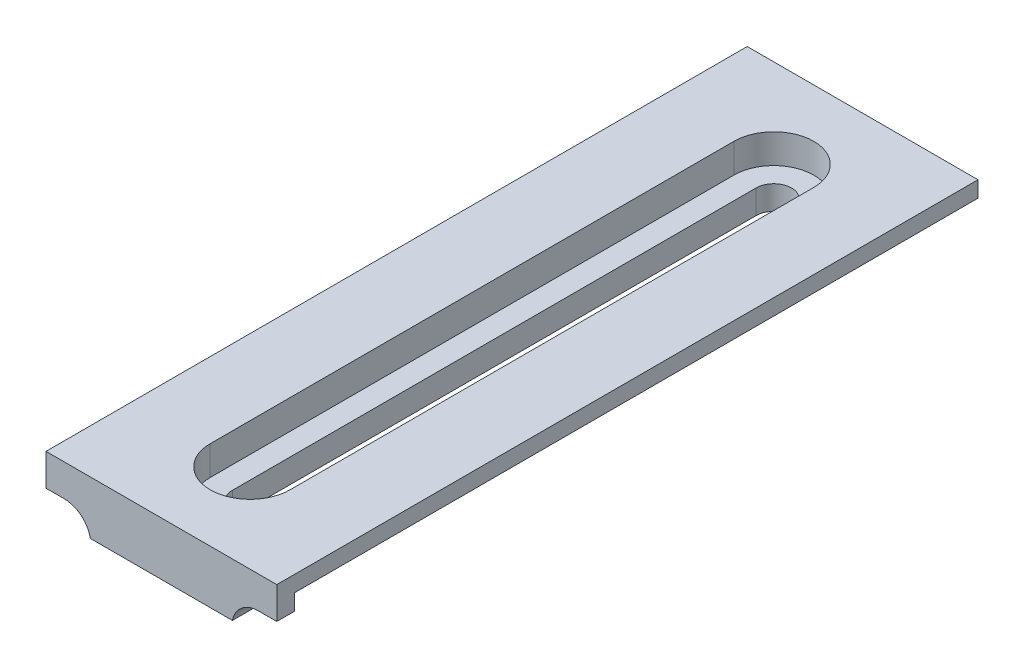
ISO-10303-21;
HEADER;
FILE_DESCRIPTION(('STEP AP214'),'2;1');
FILE_NAME('part.step','',(''),(''),'','','');
FILE_SCHEMA(('AUTOMOTIVE_DESIGN { 1 0 10303 214 1 1 1 1 }'));
ENDSEC;
DATA;
#1=APPLICATION_CONTEXT('core data for automotive mechanical design processes');
#2=APPLICATION_PROTOCOL_DEFINITION('international standard','automotive_design',2000,#1);
#3=PRODUCT_CONTEXT('',#1,'mechanical');
#4=PRODUCT('Part','Part','',(#3));
#5=PRODUCT_RELATED_PRODUCT_CATEGORY('part','',(#4));
#6=PRODUCT_DEFINITION_FORMATION('','',#4);
#7=PRODUCT_DEFINITION_CONTEXT('part definition',#1,'design');
#8=PRODUCT_DEFINITION('design','',#6,#7);
#9=PRODUCT_DEFINITION_SHAPE('','',#8);
#10=(LENGTH_UNIT() NAMED_UNIT(*) SI_UNIT(.MILLI.,.METRE.));
#11=(NAMED_UNIT(*) PLANE_ANGLE_UNIT() SI_UNIT($,.RADIAN.));
#12=(NAMED_UNIT(*) SI_UNIT($,.STERADIAN.) SOLID_ANGLE_UNIT());
#13=UNCERTAINTY_MEASURE_WITH_UNIT(LENGTH_MEASURE(1.E-05),#10,'distance_accuracy_value','');
#14=(GEOMETRIC_REPRESENTATION_CONTEXT(3) GLOBAL_UNCERTAINTY_ASSIGNED_CONTEXT((#13)) GLOBAL_UNIT_ASSIGNED_CONTEXT((#10,
#11,#12)) REPRESENTATION_CONTEXT('',''));
#15=CARTESIAN_POINT('',(0.,0.,0.));
#16=DIRECTION('',(0.,0.,1.));
#17=DIRECTION('',(1.,0.,0.));
#18=AXIS2_PLACEMENT_3D('',#15,#16,#17);
#19=CARTESIAN_POINT('',(-8.,0.,79.));
#20=DIRECTION('',(0.,1.,0.));
#21=DIRECTION('',(-1.,0.,0.));
#22=AXIS2_PLACEMENT_3D('',#19,#20,#21);
#23=PLANE('',#22);
#24=DIRECTION('',(1.,0.,0.));
#25=VECTOR('',#24,1.);
#26=CARTESIAN_POINT('',(-8.,0.,77.));
#27=LINE('',#26,#25);
#28=CARTESIAN_POINT('',(-13.,0.,77.));
#29=VERTEX_POINT('',#28);
#30=CARTESIAN_POINT('',(-8.,0.,77.));
#31=VERTEX_POINT('',#30);
#32=EDGE_CURVE('E208',#29,#31,#27,.T.);
#33=ORIENTED_EDGE('',*,*,#32,.F.);
#34=DIRECTION('',(0.,0.,-1.));
#35=VECTOR('',#34,1.);
#36=CARTESIAN_POINT('',(-13.,0.,79.));
#37=LINE('',#36,#35);
#38=CARTESIAN_POINT('',(-13.,0.,0.));
#39=VERTEX_POINT('',#38);
#40=EDGE_CURVE('E183',#29,#39,#37,.T.);
#41=ORIENTED_EDGE('',*,*,#40,.T.);
#42=DIRECTION('',(1.,0.,0.));
#43=VECTOR('',#42,1.);
#44=CARTESIAN_POINT('',(-8.,0.,0.));
#45=LINE('',#44,#43);
#46=CARTESIAN_POINT('',(-8.,0.,0.));
#47=VERTEX_POINT('',#46);
#48=EDGE_CURVE('E263',#39,#47,#45,.T.);
#49=ORIENTED_EDGE('',*,*,#48,.T.);
#50=DIRECTION('',(0.,0.,-1.));
#51=VECTOR('',#50,1.);
#52=CARTESIAN_POINT('',(-8.,0.,79.));
#53=LINE('',#52,#51);
#54=EDGE_CURVE('E317',#31,#47,#53,.T.);
#55=ORIENTED_EDGE('',*,*,#54,.F.);
#56=EDGE_LOOP('',(#33,#41,#49,#55));
#57=FACE_BOUND('',#56,.T.);
#58=ADVANCED_FACE('F34',(#57),#23,.F.);
#59=CARTESIAN_POINT('',(13.,0.,79.));
#60=DIRECTION('',(0.,1.,0.));
#61=DIRECTION('',(-1.,0.,0.));
#62=AXIS2_PLACEMENT_3D('',#59,#60,#61);
#63=PLANE('',#62);
#64=DIRECTION('',(1.,0.,0.));
#65=VECTOR('',#64,1.);
#66=CARTESIAN_POINT('',(13.,0.,77.));
#67=LINE('',#66,#65);
#68=CARTESIAN_POINT('',(8.,0.,77.));
#69=VERTEX_POINT('',#68);
#70=CARTESIAN_POINT('',(13.,0.,77.));
#71=VERTEX_POINT('',#70);
#72=EDGE_CURVE('E201',#69,#71,#67,.T.);
#73=ORIENTED_EDGE('',*,*,#72,.F.);
#74=DIRECTION('',(0.,0.,-1.));
#75=VECTOR('',#74,1.);
#76=CARTESIAN_POINT('',(8.,0.,79.));
#77=LINE('',#76,#75);
#78=CARTESIAN_POINT('',(8.,0.,0.));
#79=VERTEX_POINT('',#78);
#80=EDGE_CURVE('E307',#69,#79,#77,.T.);
#81=ORIENTED_EDGE('',*,*,#80,.T.);
#82=DIRECTION('',(1.,0.,0.));
#83=VECTOR('',#82,1.);
#84=CARTESIAN_POINT('',(13.,0.,0.));
#85=LINE('',#84,#83);
#86=CARTESIAN_POINT('',(13.,0.,0.));
#87=VERTEX_POINT('',#86);
#88=EDGE_CURVE('E290',#79,#87,#85,.T.);
#89=ORIENTED_EDGE('',*,*,#88,.T.);
#90=DIRECTION('',(0.,0.,-1.));
#91=VECTOR('',#90,1.);
#92=CARTESIAN_POINT('',(13.,0.,79.));
#93=LINE('',#92,#91);
#94=EDGE_CURVE('E305',#71,#87,#93,.T.);
#95=ORIENTED_EDGE('',*,*,#94,.F.);
#96=EDGE_LOOP('',(#73,#81,#89,#95));
#97=FACE_BOUND('',#96,.T.);
#98=ADVANCED_FACE('F365',(#97),#63,.F.);
#99=CARTESIAN_POINT('',(0.,1.8,69.));
#100=DIRECTION('',(0.,-1.,0.));
#101=DIRECTION('',(0.,0.,-1.));
#102=AXIS2_PLACEMENT_3D('',#99,#100,#101);
#103=CYLINDRICAL_SURFACE('',#102,2.);
#104=CARTESIAN_POINT('',(0.,-1.5,69.));
#105=DIRECTION('',(0.,1.,0.));
#106=DIRECTION('',(0.,0.,1.));
#107=AXIS2_PLACEMENT_3D('',#104,#105,#106);
#108=CIRCLE('',#107,2.);
#109=CARTESIAN_POINT('',(2.,-1.5,69.));
#110=VERTEX_POINT('',#109);
#111=CARTESIAN_POINT('',(-2.,-1.5,69.));
#112=VERTEX_POINT('',#111);
#113=EDGE_CURVE('E246',#110,#112,#108,.F.);
#114=ORIENTED_EDGE('',*,*,#113,.F.);
#115=DIRECTION('',(0.,-1.,0.));
#116=VECTOR('',#115,1.);
#117=CARTESIAN_POINT('',(2.,1.8,69.));
#118=LINE('',#117,#116);
#119=CARTESIAN_POINT('',(2.,-4.2,69.));
#120=VERTEX_POINT('',#119);
#121=EDGE_CURVE('E261',#110,#120,#118,.T.);
#122=ORIENTED_EDGE('',*,*,#121,.T.);
#123=CARTESIAN_POINT('',(0.,-4.2,69.));
#124=DIRECTION('',(0.,-1.,0.));
#125=DIRECTION('',(0.,0.,-1.));
#126=AXIS2_PLACEMENT_3D('',#123,#124,#125);
#127=CIRCLE('',#126,2.);
#128=CARTESIAN_POINT('',(-2.,-4.2,69.));
#129=VERTEX_POINT('',#128);
#130=EDGE_CURVE('E248',#120,#129,#127,.T.);
#131=ORIENTED_EDGE('',*,*,#130,.T.);
#132=DIRECTION('',(0.,-1.,0.));
#133=VECTOR('',#132,1.);
#134=CARTESIAN_POINT('',(-2.,1.8,69.));
#135=LINE('',#134,#133);
#136=EDGE_CURVE('E260',#112,#129,#135,.T.);
#137=ORIENTED_EDGE('',*,*,#136,.F.);
#138=EDGE_LOOP('',(#114,#122,#131,#137));
#139=FACE_BOUND('',#138,.T.);
#140=ADVANCED_FACE('F387',(#139),#103,.F.);
#141=CARTESIAN_POINT('',(2.,1.8,69.));
#142=DIRECTION('',(1.,0.,0.));
#143=DIRECTION('',(0.,0.,-1.));
#144=AXIS2_PLACEMENT_3D('',#141,#142,#143);
#145=PLANE('',#144);
#146=DIRECTION('',(0.,0.,1.));
#147=VECTOR('',#146,1.);
#148=CARTESIAN_POINT('',(2.,-1.5,69.));
#149=LINE('',#148,#147);
#150=CARTESIAN_POINT('',(2.00000000000001,-1.5,10.));
#151=VERTEX_POINT('',#150);
#152=EDGE_CURVE('E244',#151,#110,#149,.T.);
#153=ORIENTED_EDGE('',*,*,#152,.F.);
#154=DIRECTION('',(0.,-1.,0.));
#155=VECTOR('',#154,1.);
#156=CARTESIAN_POINT('',(2.00000000000001,1.8,10.));
#157=LINE('',#156,#155);
#158=CARTESIAN_POINT('',(2.00000000000001,-4.2,10.));
#159=VERTEX_POINT('',#158);
#160=EDGE_CURVE('E264',#151,#159,#157,.T.);
#161=ORIENTED_EDGE('',*,*,#160,.T.);
#162=DIRECTION('',(0.,0.,1.));
#163=VECTOR('',#162,1.);
#164=CARTESIAN_POINT('',(2.,-4.2,69.));
#165=LINE('',#164,#163);
#166=EDGE_CURVE('E257',#159,#120,#165,.T.);
#167=ORIENTED_EDGE('',*,*,#166,.T.);
#168=ORIENTED_EDGE('',*,*,#121,.F.);
#169=EDGE_LOOP('',(#153,#161,#167,#168));
#170=FACE_BOUND('',#169,.T.);
#171=ADVANCED_FACE('F426',(#170),#145,.F.);
#172=CARTESIAN_POINT('',(0.,1.8,10.));
#173=DIRECTION('',(0.,-1.,0.));
#174=DIRECTION('',(0.,0.,-1.));
#175=AXIS2_PLACEMENT_3D('',#172,#173,#174);
#176=CYLINDRICAL_SURFACE('',#175,2.);
#177=CARTESIAN_POINT('',(0.,-1.5,10.));
#178=DIRECTION('',(0.,1.,0.));
#179=DIRECTION('',(0.,0.,1.));
#180=AXIS2_PLACEMENT_3D('',#177,#178,#179);
#181=CIRCLE('',#180,2.);
#182=CARTESIAN_POINT('',(-2.,-1.5,10.));
#183=VERTEX_POINT('',#182);
#184=EDGE_CURVE('E236',#183,#151,#181,.F.);
#185=ORIENTED_EDGE('',*,*,#184,.F.);
#186=DIRECTION('',(0.,-1.,0.));
#187=VECTOR('',#186,1.);
#188=CARTESIAN_POINT('',(-1.99999999999999,1.8,10.));
#189=LINE('',#188,#187);
#190=CARTESIAN_POINT('',(-1.99999999999999,-4.2,10.));
#191=VERTEX_POINT('',#190);
#192=EDGE_CURVE('E266',#183,#191,#189,.T.);
#193=ORIENTED_EDGE('',*,*,#192,.T.);
#194=CARTESIAN_POINT('',(0.,-4.2,10.));
#195=DIRECTION('',(0.,-1.,0.));
#196=DIRECTION('',(0.,0.,-1.));
#197=AXIS2_PLACEMENT_3D('',#194,#195,#196);
#198=CIRCLE('',#197,2.);
#199=EDGE_CURVE('E254',#191,#159,#198,.T.);
#200=ORIENTED_EDGE('',*,*,#199,.T.);
#201=ORIENTED_EDGE('',*,*,#160,.F.);
#202=EDGE_LOOP('',(#185,#193,#200,#201));
#203=FACE_BOUND('',#202,.T.);
#204=ADVANCED_FACE('F429',(#203),#176,.F.);
#205=CARTESIAN_POINT('',(-2.,1.8,69.));
#206=DIRECTION('',(-1.,0.,0.));
#207=DIRECTION('',(0.,0.,1.));
#208=AXIS2_PLACEMENT_3D('',#205,#206,#207);
#209=PLANE('',#208);
#210=DIRECTION('',(0.,0.,-1.));
#211=VECTOR('',#210,1.);
#212=CARTESIAN_POINT('',(-2.,-1.5,69.));
#213=LINE('',#212,#211);
#214=EDGE_CURVE('E319',#112,#183,#213,.T.);
#215=ORIENTED_EDGE('',*,*,#214,.F.);
#216=ORIENTED_EDGE('',*,*,#136,.T.);
#217=DIRECTION('',(0.,0.,-1.));
#218=VECTOR('',#217,1.);
#219=CARTESIAN_POINT('',(-2.,-4.2,69.));
#220=LINE('',#219,#218);
#221=EDGE_CURVE('E251',#129,#191,#220,.T.);
#222=ORIENTED_EDGE('',*,*,#221,.T.);
#223=ORIENTED_EDGE('',*,*,#192,.F.);
#224=EDGE_LOOP('',(#215,#216,#222,#223));
#225=FACE_BOUND('',#224,.T.);
#226=ADVANCED_FACE('F433',(#225),#209,.F.);
#227=CARTESIAN_POINT('',(-8.,-4.2,79.));
#228=DIRECTION('',(1.,0.,0.));
#229=DIRECTION('',(0.,0.,-1.));
#230=AXIS2_PLACEMENT_3D('',#227,#228,#229);
#231=PLANE('',#230);
#232=DIRECTION('',(0.,0.,-1.));
#233=VECTOR('',#232,1.);
#234=CARTESIAN_POINT('',(-8.,-4.2,79.));
#235=LINE('',#234,#233);
#236=CARTESIAN_POINT('',(-8.,-4.2,77.));
#237=VERTEX_POINT('',#236);
#238=CARTESIAN_POINT('',(-8.,-4.2,0.));
#239=VERTEX_POINT('',#238);
#240=EDGE_CURVE('E313',#237,#239,#235,.T.);
#241=ORIENTED_EDGE('',*,*,#240,.F.);
#242=DIRECTION('',(0.,-1.,0.));
#243=VECTOR('',#242,1.);
#244=CARTESIAN_POINT('',(-8.,-4.2,77.));
#245=LINE('',#244,#243);
#246=EDGE_CURVE('E206',#31,#237,#245,.T.);
#247=ORIENTED_EDGE('',*,*,#246,.F.);
#248=ORIENTED_EDGE('',*,*,#54,.T.);
#249=DIRECTION('',(0.,-1.,0.));
#250=VECTOR('',#249,1.);
#251=CARTESIAN_POINT('',(-8.,-4.2,0.));
#252=LINE('',#251,#250);
#253=EDGE_CURVE('E281',#47,#239,#252,.T.);
#254=ORIENTED_EDGE('',*,*,#253,.T.);
#255=EDGE_LOOP('',(#241,#247,#248,#254));
#256=FACE_BOUND('',#255,.T.);
#257=ADVANCED_FACE('F354',(#256),#231,.F.);
#258=CARTESIAN_POINT('',(8.,-4.2,79.));
#259=DIRECTION('',(0.,1.,0.));
#260=DIRECTION('',(0.,0.,1.));
#261=AXIS2_PLACEMENT_3D('',#258,#259,#260);
#262=PLANE('',#261);
#263=ORIENTED_EDGE('',*,*,#221,.F.);
#264=ORIENTED_EDGE('',*,*,#130,.F.);
#265=ORIENTED_EDGE('',*,*,#166,.F.);
#266=ORIENTED_EDGE('',*,*,#199,.F.);
#267=EDGE_LOOP('',(#263,#264,#265,#266));
#268=FACE_BOUND('',#267,.T.);
#269=DIRECTION('',(1.,0.,0.));
#270=VECTOR('',#269,1.);
#271=CARTESIAN_POINT('',(8.,-4.2,0.));
#272=LINE('',#271,#270);
#273=CARTESIAN_POINT('',(8.,-4.2,0.));
#274=VERTEX_POINT('',#273);
#275=EDGE_CURVE('E284',#239,#274,#272,.T.);
#276=ORIENTED_EDGE('',*,*,#275,.T.);
#277=DIRECTION('',(0.,0.,-1.));
#278=VECTOR('',#277,1.);
#279=CARTESIAN_POINT('',(8.,-4.2,79.));
#280=LINE('',#279,#278);
#281=CARTESIAN_POINT('',(8.,-4.2,77.));
#282=VERTEX_POINT('',#281);
#283=EDGE_CURVE('E309',#282,#274,#280,.T.);
#284=ORIENTED_EDGE('',*,*,#283,.F.);
#285=CARTESIAN_POINT('',(8.,-4.2,79.));
#286=VERTEX_POINT('',#285);
#287=EDGE_CURVE('E310',#286,#282,#280,.T.);
#288=ORIENTED_EDGE('',*,*,#287,.F.);
#289=DIRECTION('',(1.,0.,0.));
#290=VECTOR('',#289,1.);
#291=CARTESIAN_POINT('',(8.,-4.2,79.));
#292=LINE('',#291,#290);
#293=CARTESIAN_POINT('',(-8.,-4.2,79.));
#294=VERTEX_POINT('',#293);
#295=EDGE_CURVE('E269',#294,#286,#292,.T.);
#296=ORIENTED_EDGE('',*,*,#295,.F.);
#297=EDGE_CURVE('E314',#294,#237,#235,.T.);
#298=ORIENTED_EDGE('',*,*,#297,.T.);
#299=ORIENTED_EDGE('',*,*,#240,.T.);
#300=EDGE_LOOP('',(#276,#284,#288,#296,#298,#299));
#301=FACE_BOUND('',#300,.T.);
#302=ADVANCED_FACE('F339',(#268,#301),#262,.F.);
#303=CARTESIAN_POINT('',(8.,0.,79.));
#304=DIRECTION('',(-1.,0.,0.));
#305=DIRECTION('',(0.,0.,1.));
#306=AXIS2_PLACEMENT_3D('',#303,#304,#305);
#307=PLANE('',#306);
#308=DIRECTION('',(0.,1.,0.));
#309=VECTOR('',#308,1.);
#310=CARTESIAN_POINT('',(8.,0.,77.));
#311=LINE('',#310,#309);
#312=EDGE_CURVE('E204',#282,#69,#311,.T.);
#313=ORIENTED_EDGE('',*,*,#312,.F.);
#314=ORIENTED_EDGE('',*,*,#283,.T.);
#315=DIRECTION('',(0.,1.,0.));
#316=VECTOR('',#315,1.);
#317=CARTESIAN_POINT('',(8.,0.,0.));
#318=LINE('',#317,#316);
#319=EDGE_CURVE('E287',#274,#79,#318,.T.);
#320=ORIENTED_EDGE('',*,*,#319,.T.);
#321=ORIENTED_EDGE('',*,*,#80,.F.);
#322=EDGE_LOOP('',(#313,#314,#320,#321));
#323=FACE_BOUND('',#322,.T.);
#324=ADVANCED_FACE('F363',(#323),#307,.F.);
#325=CARTESIAN_POINT('',(13.,1.8,79.));
#326=DIRECTION('',(-1.,0.,0.));
#327=DIRECTION('',(0.,0.,1.));
#328=AXIS2_PLACEMENT_3D('',#325,#326,#327);
#329=PLANE('',#328);
#330=DIRECTION('',(0.,1.,0.));
#331=VECTOR('',#330,1.);
#332=CARTESIAN_POINT('',(13.,1.8,79.));
#333=LINE('',#332,#331);
#334=CARTESIAN_POINT('',(13.,-1.8,79.));
#335=VERTEX_POINT('',#334);
#336=CARTESIAN_POINT('',(13.,1.8,79.));
#337=VERTEX_POINT('',#336);
#338=EDGE_CURVE('E272',#335,#337,#333,.T.);
#339=ORIENTED_EDGE('',*,*,#338,.F.);
#340=DIRECTION('',(0.,0.,1.));
#341=VECTOR('',#340,1.);
#342=CARTESIAN_POINT('',(13.,-1.8,77.));
#343=LINE('',#342,#341);
#344=CARTESIAN_POINT('',(13.,-1.8,77.));
#345=VERTEX_POINT('',#344);
#346=EDGE_CURVE('E190',#345,#335,#343,.T.);
#347=ORIENTED_EDGE('',*,*,#346,.F.);
#348=DIRECTION('',(0.,1.,0.));
#349=VECTOR('',#348,1.);
#350=CARTESIAN_POINT('',(13.,-1.8,77.));
#351=LINE('',#350,#349);
#352=EDGE_CURVE('E191',#345,#71,#351,.T.);
#353=ORIENTED_EDGE('',*,*,#352,.T.);
#354=ORIENTED_EDGE('',*,*,#94,.T.);
#355=DIRECTION('',(0.,1.,0.));
#356=VECTOR('',#355,1.);
#357=CARTESIAN_POINT('',(13.,1.8,0.));
#358=LINE('',#357,#356);
#359=CARTESIAN_POINT('',(13.,1.8,0.));
#360=VERTEX_POINT('',#359);
#361=EDGE_CURVE('E293',#87,#360,#358,.T.);
#362=ORIENTED_EDGE('',*,*,#361,.T.);
#363=DIRECTION('',(0.,0.,-1.));
#364=VECTOR('',#363,1.);
#365=CARTESIAN_POINT('',(13.,1.8,79.));
#366=LINE('',#365,#364);
#367=EDGE_CURVE('E303',#337,#360,#366,.T.);
#368=ORIENTED_EDGE('',*,*,#367,.F.);
#369=EDGE_LOOP('',(#339,#347,#353,#354,#362,#368));
#370=FACE_BOUND('',#369,.T.);
#371=ADVANCED_FACE('F370',(#370),#329,.F.);
#372=CARTESIAN_POINT('',(-13.,1.8,79.));
#373=DIRECTION('',(0.,-1.,0.));
#374=DIRECTION('',(0.,0.,-1.));
#375=AXIS2_PLACEMENT_3D('',#372,#373,#374);
#376=PLANE('',#375);
#377=ORIENTED_EDGE('',*,*,#367,.T.);
#378=DIRECTION('',(-1.,0.,0.));
#379=VECTOR('',#378,1.);
#380=CARTESIAN_POINT('',(-13.,1.8,0.));
#381=LINE('',#380,#379);
#382=CARTESIAN_POINT('',(-13.,1.8,0.));
#383=VERTEX_POINT('',#382);
#384=EDGE_CURVE('E296',#360,#383,#381,.T.);
#385=ORIENTED_EDGE('',*,*,#384,.T.);
#386=DIRECTION('',(0.,0.,-1.));
#387=VECTOR('',#386,1.);
#388=CARTESIAN_POINT('',(-13.,1.8,79.));
#389=LINE('',#388,#387);
#390=CARTESIAN_POINT('',(-13.,1.8,79.));
#391=VERTEX_POINT('',#390);
#392=EDGE_CURVE('E301',#391,#383,#389,.T.);
#393=ORIENTED_EDGE('',*,*,#392,.F.);
#394=DIRECTION('',(-1.,0.,0.));
#395=VECTOR('',#394,1.);
#396=CARTESIAN_POINT('',(-13.,1.8,79.));
#397=LINE('',#396,#395);
#398=EDGE_CURVE('E275',#337,#391,#397,.T.);
#399=ORIENTED_EDGE('',*,*,#398,.F.);
#400=EDGE_LOOP('',(#377,#385,#393,#399));
#401=FACE_BOUND('',#400,.T.);
#402=DIRECTION('',(0.,0.,-1.));
#403=VECTOR('',#402,1.);
#404=CARTESIAN_POINT('',(4.5,1.8,69.));
#405=LINE('',#404,#403);
#406=CARTESIAN_POINT('',(4.5,1.8,69.));
#407=VERTEX_POINT('',#406);
#408=CARTESIAN_POINT('',(4.50000000000001,1.8,10.));
#409=VERTEX_POINT('',#408);
#410=EDGE_CURVE('E226',#407,#409,#405,.T.);
#411=ORIENTED_EDGE('',*,*,#410,.F.);
#412=CARTESIAN_POINT('',(0.,1.8,69.));
#413=DIRECTION('',(0.,1.,0.));
#414=DIRECTION('',(0.,0.,1.));
#415=AXIS2_PLACEMENT_3D('',#412,#413,#414);
#416=CIRCLE('',#415,4.5);
#417=CARTESIAN_POINT('',(-4.5,1.8,69.));
#418=VERTEX_POINT('',#417);
#419=EDGE_CURVE('E210',#418,#407,#416,.T.);
#420=ORIENTED_EDGE('',*,*,#419,.F.);
#421=DIRECTION('',(0.,0.,1.));
#422=VECTOR('',#421,1.);
#423=CARTESIAN_POINT('',(-4.5,1.8,69.));
#424=LINE('',#423,#422);
#425=CARTESIAN_POINT('',(-4.5,1.8,10.));
#426=VERTEX_POINT('',#425);
#427=EDGE_CURVE('E215',#426,#418,#424,.T.);
#428=ORIENTED_EDGE('',*,*,#427,.F.);
#429=CARTESIAN_POINT('',(0.,1.8,10.));
#430=DIRECTION('',(0.,1.,0.));
#431=DIRECTION('',(0.,0.,1.));
#432=AXIS2_PLACEMENT_3D('',#429,#430,#431);
#433=CIRCLE('',#432,4.5);
#434=EDGE_CURVE('E229',#409,#426,#433,.T.);
#435=ORIENTED_EDGE('',*,*,#434,.F.);
#436=EDGE_LOOP('',(#411,#420,#428,#435));
#437=FACE_BOUND('',#436,.T.);
#438=ADVANCED_FACE('F378',(#401,#437),#376,.F.);
#439=CARTESIAN_POINT('',(-13.,0.,79.));
#440=DIRECTION('',(1.,0.,0.));
#441=DIRECTION('',(0.,0.,-1.));
#442=AXIS2_PLACEMENT_3D('',#439,#440,#441);
#443=PLANE('',#442);
#444=ORIENTED_EDGE('',*,*,#392,.T.);
#445=DIRECTION('',(0.,-1.,0.));
#446=VECTOR('',#445,1.);
#447=CARTESIAN_POINT('',(-13.,0.,0.));
#448=LINE('',#447,#446);
#449=EDGE_CURVE('E273',#383,#39,#448,.T.);
#450=ORIENTED_EDGE('',*,*,#449,.T.);
#451=ORIENTED_EDGE('',*,*,#40,.F.);
#452=DIRECTION('',(0.,-1.,0.));
#453=VECTOR('',#452,1.);
#454=CARTESIAN_POINT('',(-13.,-1.8,77.));
#455=LINE('',#454,#453);
#456=CARTESIAN_POINT('',(-13.,-1.8,77.));
#457=VERTEX_POINT('',#456);
#458=EDGE_CURVE('E177',#29,#457,#455,.T.);
#459=ORIENTED_EDGE('',*,*,#458,.T.);
#460=DIRECTION('',(0.,0.,1.));
#461=VECTOR('',#460,1.);
#462=CARTESIAN_POINT('',(-13.,-1.8,77.));
#463=LINE('',#462,#461);
#464=CARTESIAN_POINT('',(-13.,-1.8,79.));
#465=VERTEX_POINT('',#464);
#466=EDGE_CURVE('E181',#457,#465,#463,.T.);
#467=ORIENTED_EDGE('',*,*,#466,.T.);
#468=DIRECTION('',(0.,-1.,0.));
#469=VECTOR('',#468,1.);
#470=CARTESIAN_POINT('',(-13.,0.,79.));
#471=LINE('',#470,#469);
#472=EDGE_CURVE('E277',#391,#465,#471,.T.);
#473=ORIENTED_EDGE('',*,*,#472,.F.);
#474=EDGE_LOOP('',(#444,#450,#451,#459,#467,#473));
#475=FACE_BOUND('',#474,.T.);
#476=ADVANCED_FACE('F179',(#475),#443,.F.);
#477=CARTESIAN_POINT('',(0.,0.,79.));
#478=DIRECTION('',(0.,0.,-1.));
#479=DIRECTION('',(-1.,0.,0.));
#480=AXIS2_PLACEMENT_3D('',#477,#478,#479);
#481=PLANE('',#480);
#482=ORIENTED_EDGE('',*,*,#295,.T.);
#483=CARTESIAN_POINT('',(10.9393876913398,-4.8,79.));
#484=DIRECTION('',(0.,0.,-1.));
#485=DIRECTION('',(-1.,0.,0.));
#486=AXIS2_PLACEMENT_3D('',#483,#484,#485);
#487=CIRCLE('',#486,3.);
#488=CARTESIAN_POINT('',(10.9393876913398,-1.8,79.));
#489=VERTEX_POINT('',#488);
#490=EDGE_CURVE('E324',#286,#489,#487,.T.);
#491=ORIENTED_EDGE('',*,*,#490,.T.);
#492=DIRECTION('',(1.,0.,0.));
#493=VECTOR('',#492,1.);
#494=CARTESIAN_POINT('',(13.,-1.8,79.));
#495=LINE('',#494,#493);
#496=EDGE_CURVE('E199',#489,#335,#495,.T.);
#497=ORIENTED_EDGE('',*,*,#496,.T.);
#498=ORIENTED_EDGE('',*,*,#338,.T.);
#499=ORIENTED_EDGE('',*,*,#398,.T.);
#500=ORIENTED_EDGE('',*,*,#472,.T.);
#501=CARTESIAN_POINT('',(-10.9393876913398,-1.8,79.));
#502=VERTEX_POINT('',#501);
#503=EDGE_CURVE('E186',#465,#502,#495,.T.);
#504=ORIENTED_EDGE('',*,*,#503,.T.);
#505=CARTESIAN_POINT('',(-10.9393876913398,-4.8,79.));
#506=DIRECTION('',(0.,0.,-1.));
#507=DIRECTION('',(-1.,0.,0.));
#508=AXIS2_PLACEMENT_3D('',#505,#506,#507);
#509=CIRCLE('',#508,3.);
#510=EDGE_CURVE('E11',#502,#294,#509,.T.);
#511=ORIENTED_EDGE('',*,*,#510,.T.);
#512=EDGE_LOOP('',(#482,#491,#497,#498,#499,#500,#504,#511));
#513=FACE_BOUND('',#512,.T.);
#514=ADVANCED_FACE('F347',(#513),#481,.F.);
#515=CARTESIAN_POINT('',(0.,0.,0.));
#516=DIRECTION('',(0.,0.,-1.));
#517=DIRECTION('',(-1.,0.,0.));
#518=AXIS2_PLACEMENT_3D('',#515,#516,#517);
#519=PLANE('',#518);
#520=ORIENTED_EDGE('',*,*,#48,.F.);
#521=ORIENTED_EDGE('',*,*,#449,.F.);
#522=ORIENTED_EDGE('',*,*,#384,.F.);
#523=ORIENTED_EDGE('',*,*,#361,.F.);
#524=ORIENTED_EDGE('',*,*,#88,.F.);
#525=ORIENTED_EDGE('',*,*,#319,.F.);
#526=ORIENTED_EDGE('',*,*,#275,.F.);
#527=ORIENTED_EDGE('',*,*,#253,.F.);
#528=EDGE_LOOP('',(#520,#521,#522,#523,#524,#525,#526,#527));
#529=FACE_BOUND('',#528,.T.);
#530=ADVANCED_FACE('F359',(#529),#519,.T.);
#531=CARTESIAN_POINT('',(0.,-1.5,69.));
#532=DIRECTION('',(0.,1.,0.));
#533=DIRECTION('',(0.,0.,1.));
#534=AXIS2_PLACEMENT_3D('',#531,#532,#533);
#535=PLANE('',#534);
#536=CARTESIAN_POINT('',(0.,-1.5,69.));
#537=DIRECTION('',(0.,1.,0.));
#538=DIRECTION('',(0.,0.,1.));
#539=AXIS2_PLACEMENT_3D('',#536,#537,#538);
#540=CIRCLE('',#539,4.5);
#541=CARTESIAN_POINT('',(-4.5,-1.5,69.));
#542=VERTEX_POINT('',#541);
#543=CARTESIAN_POINT('',(4.5,-1.5,69.));
#544=VERTEX_POINT('',#543);
#545=EDGE_CURVE('E211',#542,#544,#540,.T.);
#546=ORIENTED_EDGE('',*,*,#545,.T.);
#547=DIRECTION('',(0.,0.,-1.));
#548=VECTOR('',#547,1.);
#549=CARTESIAN_POINT('',(4.5,-1.5,69.));
#550=LINE('',#549,#548);
#551=CARTESIAN_POINT('',(4.50000000000001,-1.5,10.));
#552=VERTEX_POINT('',#551);
#553=EDGE_CURVE('E214',#544,#552,#550,.T.);
#554=ORIENTED_EDGE('',*,*,#553,.T.);
#555=CARTESIAN_POINT('',(0.,-1.5,10.));
#556=DIRECTION('',(0.,1.,0.));
#557=DIRECTION('',(0.,0.,1.));
#558=AXIS2_PLACEMENT_3D('',#555,#556,#557);
#559=CIRCLE('',#558,4.5);
#560=CARTESIAN_POINT('',(-4.5,-1.5,10.));
#561=VERTEX_POINT('',#560);
#562=EDGE_CURVE('E218',#552,#561,#559,.T.);
#563=ORIENTED_EDGE('',*,*,#562,.T.);
#564=DIRECTION('',(0.,0.,1.));
#565=VECTOR('',#564,1.);
#566=CARTESIAN_POINT('',(-4.5,-1.5,69.));
#567=LINE('',#566,#565);
#568=EDGE_CURVE('E221',#561,#542,#567,.T.);
#569=ORIENTED_EDGE('',*,*,#568,.T.);
#570=EDGE_LOOP('',(#546,#554,#563,#569));
#571=FACE_BOUND('',#570,.T.);
#572=ORIENTED_EDGE('',*,*,#113,.T.);
#573=ORIENTED_EDGE('',*,*,#214,.T.);
#574=ORIENTED_EDGE('',*,*,#184,.T.);
#575=ORIENTED_EDGE('',*,*,#152,.T.);
#576=EDGE_LOOP('',(#572,#573,#574,#575));
#577=FACE_BOUND('',#576,.T.);
#578=ADVANCED_FACE('F424',(#571,#577),#535,.T.);
#579=CARTESIAN_POINT('',(0.,-1.5,69.));
#580=DIRECTION('',(0.,1.,0.));
#581=DIRECTION('',(0.,0.,1.));
#582=AXIS2_PLACEMENT_3D('',#579,#580,#581);
#583=CYLINDRICAL_SURFACE('',#582,4.5);
#584=ORIENTED_EDGE('',*,*,#419,.T.);
#585=DIRECTION('',(0.,1.,0.));
#586=VECTOR('',#585,1.);
#587=CARTESIAN_POINT('',(4.5,-1.5,69.));
#588=LINE('',#587,#586);
#589=EDGE_CURVE('E224',#544,#407,#588,.T.);
#590=ORIENTED_EDGE('',*,*,#589,.F.);
#591=ORIENTED_EDGE('',*,*,#545,.F.);
#592=DIRECTION('',(0.,1.,0.));
#593=VECTOR('',#592,1.);
#594=CARTESIAN_POINT('',(-4.5,-1.5,69.));
#595=LINE('',#594,#593);
#596=EDGE_CURVE('E234',#542,#418,#595,.T.);
#597=ORIENTED_EDGE('',*,*,#596,.T.);
#598=EDGE_LOOP('',(#584,#590,#591,#597));
#599=FACE_BOUND('',#598,.T.);
#600=ADVANCED_FACE('F421',(#599),#583,.F.);
#601=CARTESIAN_POINT('',(-4.5,-1.5,69.));
#602=DIRECTION('',(-1.,0.,0.));
#603=DIRECTION('',(0.,0.,1.));
#604=AXIS2_PLACEMENT_3D('',#601,#602,#603);
#605=PLANE('',#604);
#606=ORIENTED_EDGE('',*,*,#427,.T.);
#607=ORIENTED_EDGE('',*,*,#596,.F.);
#608=ORIENTED_EDGE('',*,*,#568,.F.);
#609=DIRECTION('',(0.,1.,0.));
#610=VECTOR('',#609,1.);
#611=CARTESIAN_POINT('',(-4.5,-1.5,10.));
#612=LINE('',#611,#610);
#613=EDGE_CURVE('E237',#561,#426,#612,.T.);
#614=ORIENTED_EDGE('',*,*,#613,.T.);
#615=EDGE_LOOP('',(#606,#607,#608,#614));
#616=FACE_BOUND('',#615,.T.);
#617=ADVANCED_FACE('F416',(#616),#605,.F.);
#618=CARTESIAN_POINT('',(0.,-1.5,10.));
#619=DIRECTION('',(0.,1.,0.));
#620=DIRECTION('',(0.,0.,1.));
#621=AXIS2_PLACEMENT_3D('',#618,#619,#620);
#622=CYLINDRICAL_SURFACE('',#621,4.5);
#623=ORIENTED_EDGE('',*,*,#434,.T.);
#624=ORIENTED_EDGE('',*,*,#613,.F.);
#625=ORIENTED_EDGE('',*,*,#562,.F.);
#626=DIRECTION('',(0.,1.,0.));
#627=VECTOR('',#626,1.);
#628=CARTESIAN_POINT('',(4.50000000000001,-1.5,10.));
#629=LINE('',#628,#627);
#630=EDGE_CURVE('E239',#552,#409,#629,.T.);
#631=ORIENTED_EDGE('',*,*,#630,.T.);
#632=EDGE_LOOP('',(#623,#624,#625,#631));
#633=FACE_BOUND('',#632,.T.);
#634=ADVANCED_FACE('F410',(#633),#622,.F.);
#635=CARTESIAN_POINT('',(4.5,-1.5,69.));
#636=DIRECTION('',(1.,0.,0.));
#637=DIRECTION('',(0.,0.,-1.));
#638=AXIS2_PLACEMENT_3D('',#635,#636,#637);
#639=PLANE('',#638);
#640=ORIENTED_EDGE('',*,*,#410,.T.);
#641=ORIENTED_EDGE('',*,*,#630,.F.);
#642=ORIENTED_EDGE('',*,*,#553,.F.);
#643=ORIENTED_EDGE('',*,*,#589,.T.);
#644=EDGE_LOOP('',(#640,#641,#642,#643));
#645=FACE_BOUND('',#644,.T.);
#646=ADVANCED_FACE('F406',(#645),#639,.F.);
#647=CARTESIAN_POINT('',(0.,0.,77.));
#648=DIRECTION('',(0.,0.,1.));
#649=DIRECTION('',(1.,0.,0.));
#650=AXIS2_PLACEMENT_3D('',#647,#648,#649);
#651=PLANE('',#650);
#652=DIRECTION('',(1.,0.,0.));
#653=VECTOR('',#652,1.);
#654=CARTESIAN_POINT('',(13.,-1.8,77.));
#655=LINE('',#654,#653);
#656=CARTESIAN_POINT('',(10.9393876913398,-1.8,77.));
#657=VERTEX_POINT('',#656);
#658=EDGE_CURVE('E185',#657,#345,#655,.T.);
#659=ORIENTED_EDGE('',*,*,#658,.F.);
#660=CARTESIAN_POINT('',(10.9393876913398,-4.8,77.));
#661=DIRECTION('',(0.,0.,1.));
#662=DIRECTION('',(1.,0.,0.));
#663=AXIS2_PLACEMENT_3D('',#660,#661,#662);
#664=CIRCLE('',#663,3.);
#665=EDGE_CURVE('E326',#657,#282,#664,.T.);
#666=ORIENTED_EDGE('',*,*,#665,.T.);
#667=ORIENTED_EDGE('',*,*,#312,.T.);
#668=ORIENTED_EDGE('',*,*,#72,.T.);
#669=ORIENTED_EDGE('',*,*,#352,.F.);
#670=EDGE_LOOP('',(#659,#666,#667,#668,#669));
#671=FACE_BOUND('',#670,.T.);
#672=ADVANCED_FACE('F332',(#671),#651,.F.);
#673=CARTESIAN_POINT('',(13.,-1.8,77.));
#674=DIRECTION('',(0.,-1.,0.));
#675=DIRECTION('',(0.,0.,-1.));
#676=AXIS2_PLACEMENT_3D('',#673,#674,#675);
#677=PLANE('',#676);
#678=ORIENTED_EDGE('',*,*,#496,.F.);
#679=DIRECTION('',(0.,0.,1.));
#680=VECTOR('',#679,1.);
#681=CARTESIAN_POINT('',(10.9393876913398,-1.8,77.));
#682=LINE('',#681,#680);
#683=EDGE_CURVE('E321',#489,#657,#682,.F.);
#684=ORIENTED_EDGE('',*,*,#683,.T.);
#685=ORIENTED_EDGE('',*,*,#658,.T.);
#686=ORIENTED_EDGE('',*,*,#346,.T.);
#687=EDGE_LOOP('',(#678,#684,#685,#686));
#688=FACE_BOUND('',#687,.T.);
#689=ADVANCED_FACE('F373',(#688),#677,.T.);
#690=ORIENTED_EDGE('',*,*,#458,.F.);
#691=ORIENTED_EDGE('',*,*,#32,.T.);
#692=ORIENTED_EDGE('',*,*,#246,.T.);
#693=CARTESIAN_POINT('',(-10.9393876913398,-4.8,77.));
#694=DIRECTION('',(0.,0.,1.));
#695=DIRECTION('',(1.,0.,0.));
#696=AXIS2_PLACEMENT_3D('',#693,#694,#695);
#697=CIRCLE('',#696,3.);
#698=CARTESIAN_POINT('',(-10.9393876913398,-1.8,77.));
#699=VERTEX_POINT('',#698);
#700=EDGE_CURVE('E42',#237,#699,#697,.T.);
#701=ORIENTED_EDGE('',*,*,#700,.T.);
#702=EDGE_CURVE('E189',#457,#699,#655,.T.);
#703=ORIENTED_EDGE('',*,*,#702,.F.);
#704=EDGE_LOOP('',(#690,#691,#692,#701,#703));
#705=FACE_BOUND('',#704,.T.);
#706=ADVANCED_FACE('F193',(#705),#651,.F.);
#707=ORIENTED_EDGE('',*,*,#702,.T.);
#708=DIRECTION('',(0.,0.,-1.));
#709=VECTOR('',#708,1.);
#710=CARTESIAN_POINT('',(-10.9393876913398,-1.8,79.));
#711=LINE('',#710,#709);
#712=EDGE_CURVE('E55',#699,#502,#711,.F.);
#713=ORIENTED_EDGE('',*,*,#712,.T.);
#714=ORIENTED_EDGE('',*,*,#503,.F.);
#715=ORIENTED_EDGE('',*,*,#466,.F.);
#716=EDGE_LOOP('',(#707,#713,#714,#715));
#717=FACE_BOUND('',#716,.T.);
#718=ADVANCED_FACE('F188',(#717),#677,.T.);
#719=CARTESIAN_POINT('',(10.9393876913398,-4.8,79.));
#720=DIRECTION('',(0.,0.,-1.));
#721=DIRECTION('',(-1.,0.,0.));
#722=AXIS2_PLACEMENT_3D('',#719,#720,#721);
#723=CYLINDRICAL_SURFACE('',#722,3.);
#724=ORIENTED_EDGE('',*,*,#665,.F.);
#725=ORIENTED_EDGE('',*,*,#683,.F.);
#726=ORIENTED_EDGE('',*,*,#490,.F.);
#727=ORIENTED_EDGE('',*,*,#287,.T.);
#728=EDGE_LOOP('',(#724,#725,#726,#727));
#729=FACE_BOUND('',#728,.T.);
#730=ADVANCED_FACE('F344',(#729),#723,.F.);
#731=CARTESIAN_POINT('',(-10.9393876913398,-4.8,79.));
#732=DIRECTION('',(0.,0.,1.));
#733=DIRECTION('',(1.,0.,0.));
#734=AXIS2_PLACEMENT_3D('',#731,#732,#733);
#735=CYLINDRICAL_SURFACE('',#734,3.);
#736=ORIENTED_EDGE('',*,*,#510,.F.);
#737=ORIENTED_EDGE('',*,*,#712,.F.);
#738=ORIENTED_EDGE('',*,*,#700,.F.);
#739=ORIENTED_EDGE('',*,*,#297,.F.);
#740=EDGE_LOOP('',(#736,#737,#738,#739));
#741=FACE_BOUND('',#740,.T.);
#742=ADVANCED_FACE('F36',(#741),#735,.F.);
#743=CLOSED_SHELL('',(#58,#98,#140,#171,#204,#226,#257,#302,#324,#371,#438,#476,#514,#530,#578,
#600,#617,#634,#646,#672,#689,#706,#718,#730,#742));
#744=MANIFOLD_SOLID_BREP('B2',#743);
#745=ADVANCED_BREP_SHAPE_REPRESENTATION('',(#18,#744),#14);
#746=SHAPE_DEFINITION_REPRESENTATION(#9,#745);
ENDSEC;
END-ISO-10303-21;
